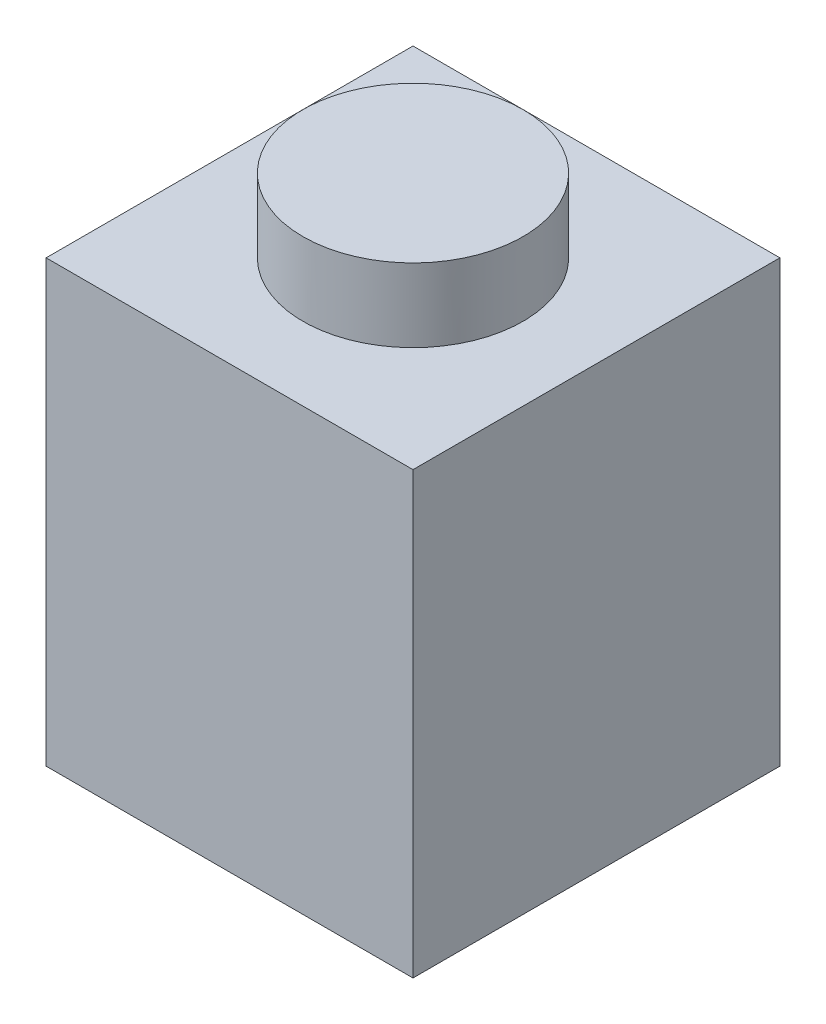
ISO-10303-21;
HEADER;
FILE_DESCRIPTION(('STEP AP214'),'2;1');
FILE_NAME('part.step','',(''),(''),'','','');
FILE_SCHEMA(('AUTOMOTIVE_DESIGN { 1 0 10303 214 1 1 1 1 }'));
ENDSEC;
DATA;
#1=APPLICATION_CONTEXT('core data for automotive mechanical design processes');
#2=APPLICATION_PROTOCOL_DEFINITION('international standard','automotive_design',2000,#1);
#3=PRODUCT_CONTEXT('',#1,'mechanical');
#4=PRODUCT('Part','Part','',(#3));
#5=PRODUCT_RELATED_PRODUCT_CATEGORY('part','',(#4));
#6=PRODUCT_DEFINITION_FORMATION('','',#4);
#7=PRODUCT_DEFINITION_CONTEXT('part definition',#1,'design');
#8=PRODUCT_DEFINITION('design','',#6,#7);
#9=PRODUCT_DEFINITION_SHAPE('','',#8);
#10=(LENGTH_UNIT() NAMED_UNIT(*) SI_UNIT(.MILLI.,.METRE.));
#11=(NAMED_UNIT(*) PLANE_ANGLE_UNIT() SI_UNIT($,.RADIAN.));
#12=(NAMED_UNIT(*) SI_UNIT($,.STERADIAN.) SOLID_ANGLE_UNIT());
#13=UNCERTAINTY_MEASURE_WITH_UNIT(LENGTH_MEASURE(1.E-05),#10,'distance_accuracy_value','');
#14=(GEOMETRIC_REPRESENTATION_CONTEXT(3) GLOBAL_UNCERTAINTY_ASSIGNED_CONTEXT((#13)) GLOBAL_UNIT_ASSIGNED_CONTEXT((#10,
#11,#12)) REPRESENTATION_CONTEXT('',''));
#15=CARTESIAN_POINT('',(0.,0.,0.));
#16=DIRECTION('',(0.,0.,1.));
#17=DIRECTION('',(1.,0.,0.));
#18=AXIS2_PLACEMENT_3D('',#15,#16,#17);
#19=CARTESIAN_POINT('',(0.,0.,0.));
#20=DIRECTION('',(0.,-1.,0.));
#21=DIRECTION('',(0.,0.,-1.));
#22=AXIS2_PLACEMENT_3D('',#19,#20,#21);
#23=PLANE('',#22);
#24=DIRECTION('',(0.,0.,1.));
#25=VECTOR('',#24,1.);
#26=CARTESIAN_POINT('',(0.,0.,0.));
#27=LINE('',#26,#25);
#28=CARTESIAN_POINT('',(0.,0.,-8.));
#29=VERTEX_POINT('',#28);
#30=CARTESIAN_POINT('',(0.,0.,0.));
#31=VERTEX_POINT('',#30);
#32=EDGE_CURVE('E155',#29,#31,#27,.T.);
#33=ORIENTED_EDGE('',*,*,#32,.F.);
#34=DIRECTION('',(-1.,0.,0.));
#35=VECTOR('',#34,1.);
#36=CARTESIAN_POINT('',(0.,0.,-8.));
#37=LINE('',#36,#35);
#38=CARTESIAN_POINT('',(8.,0.,-8.));
#39=VERTEX_POINT('',#38);
#40=EDGE_CURVE('E78',#39,#29,#37,.T.);
#41=ORIENTED_EDGE('',*,*,#40,.F.);
#42=DIRECTION('',(0.,0.,-1.));
#43=VECTOR('',#42,1.);
#44=CARTESIAN_POINT('',(8.00000000000001,0.,0.));
#45=LINE('',#44,#43);
#46=CARTESIAN_POINT('',(8.00000000000001,0.,0.));
#47=VERTEX_POINT('',#46);
#48=EDGE_CURVE('E167',#47,#39,#45,.T.);
#49=ORIENTED_EDGE('',*,*,#48,.F.);
#50=DIRECTION('',(1.,0.,0.));
#51=VECTOR('',#50,1.);
#52=CARTESIAN_POINT('',(0.,0.,0.));
#53=LINE('',#52,#51);
#54=EDGE_CURVE('E165',#31,#47,#53,.T.);
#55=ORIENTED_EDGE('',*,*,#54,.F.);
#56=EDGE_LOOP('',(#33,#41,#49,#55));
#57=FACE_BOUND('',#56,.T.);
#58=DIRECTION('',(-1.,0.,0.));
#59=VECTOR('',#58,1.);
#60=CARTESIAN_POINT('',(0.,0.,-6.2));
#61=LINE('',#60,#59);
#62=CARTESIAN_POINT('',(6.2,0.,-6.2));
#63=VERTEX_POINT('',#62);
#64=CARTESIAN_POINT('',(1.8,0.,-6.2));
#65=VERTEX_POINT('',#64);
#66=EDGE_CURVE('E148',#63,#65,#61,.T.);
#67=ORIENTED_EDGE('',*,*,#66,.T.);
#68=DIRECTION('',(0.,0.,1.));
#69=VECTOR('',#68,1.);
#70=CARTESIAN_POINT('',(1.8,0.,0.));
#71=LINE('',#70,#69);
#72=CARTESIAN_POINT('',(1.8,0.,-1.8));
#73=VERTEX_POINT('',#72);
#74=EDGE_CURVE('E144',#65,#73,#71,.T.);
#75=ORIENTED_EDGE('',*,*,#74,.T.);
#76=DIRECTION('',(1.,0.,0.));
#77=VECTOR('',#76,1.);
#78=CARTESIAN_POINT('',(0.,0.,-1.8));
#79=LINE('',#78,#77);
#80=CARTESIAN_POINT('',(6.20000000000001,0.,-1.8));
#81=VERTEX_POINT('',#80);
#82=EDGE_CURVE('E147',#73,#81,#79,.T.);
#83=ORIENTED_EDGE('',*,*,#82,.T.);
#84=DIRECTION('',(0.,0.,-1.));
#85=VECTOR('',#84,1.);
#86=CARTESIAN_POINT('',(6.20000000000001,0.,0.));
#87=LINE('',#86,#85);
#88=EDGE_CURVE('E48',#81,#63,#87,.T.);
#89=ORIENTED_EDGE('',*,*,#88,.T.);
#90=EDGE_LOOP('',(#67,#75,#83,#89));
#91=FACE_BOUND('',#90,.T.);
#92=ADVANCED_FACE('F33',(#57,#91),#23,.T.);
#93=CARTESIAN_POINT('',(0.,9.6,0.));
#94=DIRECTION('',(0.,-1.,0.));
#95=DIRECTION('',(0.,0.,-1.));
#96=AXIS2_PLACEMENT_3D('',#93,#94,#95);
#97=PLANE('',#96);
#98=DIRECTION('',(0.,0.,1.));
#99=VECTOR('',#98,1.);
#100=CARTESIAN_POINT('',(0.,9.6,0.));
#101=LINE('',#100,#99);
#102=CARTESIAN_POINT('',(0.,9.6,-8.));
#103=VERTEX_POINT('',#102);
#104=CARTESIAN_POINT('',(0.,9.6,0.));
#105=VERTEX_POINT('',#104);
#106=EDGE_CURVE('E156',#103,#105,#101,.T.);
#107=ORIENTED_EDGE('',*,*,#106,.T.);
#108=DIRECTION('',(1.,0.,0.));
#109=VECTOR('',#108,1.);
#110=CARTESIAN_POINT('',(0.,9.6,0.));
#111=LINE('',#110,#109);
#112=CARTESIAN_POINT('',(8.00000000000001,9.6,0.));
#113=VERTEX_POINT('',#112);
#114=EDGE_CURVE('E86',#105,#113,#111,.T.);
#115=ORIENTED_EDGE('',*,*,#114,.T.);
#116=DIRECTION('',(0.,0.,-1.));
#117=VECTOR('',#116,1.);
#118=CARTESIAN_POINT('',(8.00000000000001,9.6,0.));
#119=LINE('',#118,#117);
#120=CARTESIAN_POINT('',(8.,9.6,-8.));
#121=VERTEX_POINT('',#120);
#122=EDGE_CURVE('E159',#113,#121,#119,.T.);
#123=ORIENTED_EDGE('',*,*,#122,.T.);
#124=DIRECTION('',(-1.,0.,0.));
#125=VECTOR('',#124,1.);
#126=CARTESIAN_POINT('',(0.,9.6,-8.));
#127=LINE('',#126,#125);
#128=EDGE_CURVE('E57',#121,#103,#127,.T.);
#129=ORIENTED_EDGE('',*,*,#128,.T.);
#130=EDGE_LOOP('',(#107,#115,#123,#129));
#131=FACE_BOUND('',#130,.T.);
#132=CARTESIAN_POINT('',(4.,9.6,-4.));
#133=DIRECTION('',(0.,-1.,0.));
#134=DIRECTION('',(0.,0.,-1.));
#135=AXIS2_PLACEMENT_3D('',#132,#133,#134);
#136=CIRCLE('',#135,2.4);
#137=CARTESIAN_POINT('',(4.,9.6,-6.4));
#138=VERTEX_POINT('',#137);
#139=EDGE_CURVE('E11',#138,#138,#136,.F.);
#140=ORIENTED_EDGE('',*,*,#139,.F.);
#141=EDGE_LOOP('',(#140));
#142=FACE_BOUND('',#141,.T.);
#143=ADVANCED_FACE('F188',(#131,#142),#97,.F.);
#144=CARTESIAN_POINT('',(0.,9.6,0.));
#145=DIRECTION('',(1.,0.,0.));
#146=DIRECTION('',(0.,0.,-1.));
#147=AXIS2_PLACEMENT_3D('',#144,#145,#146);
#148=PLANE('',#147);
#149=ORIENTED_EDGE('',*,*,#32,.T.);
#150=DIRECTION('',(0.,-1.,0.));
#151=VECTOR('',#150,1.);
#152=CARTESIAN_POINT('',(0.,9.6,0.));
#153=LINE('',#152,#151);
#154=EDGE_CURVE('E41',#105,#31,#153,.T.);
#155=ORIENTED_EDGE('',*,*,#154,.F.);
#156=ORIENTED_EDGE('',*,*,#106,.F.);
#157=DIRECTION('',(0.,-1.,0.));
#158=VECTOR('',#157,1.);
#159=CARTESIAN_POINT('',(0.,9.6,-8.));
#160=LINE('',#159,#158);
#161=EDGE_CURVE('E162',#103,#29,#160,.T.);
#162=ORIENTED_EDGE('',*,*,#161,.T.);
#163=EDGE_LOOP('',(#149,#155,#156,#162));
#164=FACE_BOUND('',#163,.T.);
#165=ADVANCED_FACE('F35',(#164),#148,.F.);
#166=CARTESIAN_POINT('',(0.,9.6,0.));
#167=DIRECTION('',(0.,0.,-1.));
#168=DIRECTION('',(-1.,0.,0.));
#169=AXIS2_PLACEMENT_3D('',#166,#167,#168);
#170=PLANE('',#169);
#171=ORIENTED_EDGE('',*,*,#54,.T.);
#172=DIRECTION('',(0.,-1.,0.));
#173=VECTOR('',#172,1.);
#174=CARTESIAN_POINT('',(8.00000000000001,9.6,0.));
#175=LINE('',#174,#173);
#176=EDGE_CURVE('E173',#113,#47,#175,.T.);
#177=ORIENTED_EDGE('',*,*,#176,.F.);
#178=ORIENTED_EDGE('',*,*,#114,.F.);
#179=ORIENTED_EDGE('',*,*,#154,.T.);
#180=EDGE_LOOP('',(#171,#177,#178,#179));
#181=FACE_BOUND('',#180,.T.);
#182=ADVANCED_FACE('F176',(#181),#170,.F.);
#183=CARTESIAN_POINT('',(8.00000000000001,9.6,0.));
#184=DIRECTION('',(-1.,0.,0.));
#185=DIRECTION('',(0.,0.,1.));
#186=AXIS2_PLACEMENT_3D('',#183,#184,#185);
#187=PLANE('',#186);
#188=ORIENTED_EDGE('',*,*,#48,.T.);
#189=DIRECTION('',(0.,-1.,0.));
#190=VECTOR('',#189,1.);
#191=CARTESIAN_POINT('',(8.,9.6,-8.));
#192=LINE('',#191,#190);
#193=EDGE_CURVE('E171',#121,#39,#192,.T.);
#194=ORIENTED_EDGE('',*,*,#193,.F.);
#195=ORIENTED_EDGE('',*,*,#122,.F.);
#196=ORIENTED_EDGE('',*,*,#176,.T.);
#197=EDGE_LOOP('',(#188,#194,#195,#196));
#198=FACE_BOUND('',#197,.T.);
#199=ADVANCED_FACE('F185',(#198),#187,.F.);
#200=CARTESIAN_POINT('',(0.,9.6,-8.));
#201=DIRECTION('',(0.,0.,1.));
#202=DIRECTION('',(1.,0.,0.));
#203=AXIS2_PLACEMENT_3D('',#200,#201,#202);
#204=PLANE('',#203);
#205=ORIENTED_EDGE('',*,*,#40,.T.);
#206=ORIENTED_EDGE('',*,*,#161,.F.);
#207=ORIENTED_EDGE('',*,*,#128,.F.);
#208=ORIENTED_EDGE('',*,*,#193,.T.);
#209=EDGE_LOOP('',(#205,#206,#207,#208));
#210=FACE_BOUND('',#209,.T.);
#211=ADVANCED_FACE('F187',(#210),#204,.F.);
#212=CARTESIAN_POINT('',(4.,11.2,-4.));
#213=DIRECTION('',(0.,-1.,0.));
#214=DIRECTION('',(0.,0.,-1.));
#215=AXIS2_PLACEMENT_3D('',#212,#213,#214);
#216=CYLINDRICAL_SURFACE('',#215,2.4);
#217=CARTESIAN_POINT('',(4.,11.2,-4.));
#218=DIRECTION('',(0.,1.,0.));
#219=DIRECTION('',(0.,0.,1.));
#220=AXIS2_PLACEMENT_3D('',#217,#218,#219);
#221=CIRCLE('',#220,2.4);
#222=CARTESIAN_POINT('',(4.,11.2,-1.6));
#223=VERTEX_POINT('',#222);
#224=EDGE_CURVE('E137',#223,#223,#221,.T.);
#225=ORIENTED_EDGE('',*,*,#224,.F.);
#226=EDGE_LOOP('',(#225));
#227=FACE_BOUND('',#226,.T.);
#228=ORIENTED_EDGE('',*,*,#139,.T.);
#229=EDGE_LOOP('',(#228));
#230=FACE_BOUND('',#229,.T.);
#231=ADVANCED_FACE('F194',(#227,#230),#216,.T.);
#232=CARTESIAN_POINT('',(4.,11.2,-4.));
#233=DIRECTION('',(0.,1.,0.));
#234=DIRECTION('',(0.,0.,1.));
#235=AXIS2_PLACEMENT_3D('',#232,#233,#234);
#236=PLANE('',#235);
#237=ORIENTED_EDGE('',*,*,#224,.T.);
#238=EDGE_LOOP('',(#237));
#239=FACE_BOUND('',#238,.T.);
#240=ADVANCED_FACE('F196',(#239),#236,.T.);
#241=CARTESIAN_POINT('',(0.,7.8,0.));
#242=DIRECTION('',(0.,-1.,0.));
#243=DIRECTION('',(0.,0.,-1.));
#244=AXIS2_PLACEMENT_3D('',#241,#242,#243);
#245=PLANE('',#244);
#246=DIRECTION('',(0.,0.,1.));
#247=VECTOR('',#246,1.);
#248=CARTESIAN_POINT('',(1.8,7.8,0.));
#249=LINE('',#248,#247);
#250=CARTESIAN_POINT('',(1.8,7.8,-6.2));
#251=VERTEX_POINT('',#250);
#252=CARTESIAN_POINT('',(1.8,7.8,-1.8));
#253=VERTEX_POINT('',#252);
#254=EDGE_CURVE('E119',#251,#253,#249,.T.);
#255=ORIENTED_EDGE('',*,*,#254,.F.);
#256=DIRECTION('',(-1.,0.,0.));
#257=VECTOR('',#256,1.);
#258=CARTESIAN_POINT('',(0.,7.8,-6.2));
#259=LINE('',#258,#257);
#260=CARTESIAN_POINT('',(6.2,7.8,-6.2));
#261=VERTEX_POINT('',#260);
#262=EDGE_CURVE('E128',#261,#251,#259,.T.);
#263=ORIENTED_EDGE('',*,*,#262,.F.);
#264=DIRECTION('',(0.,0.,-1.));
#265=VECTOR('',#264,1.);
#266=CARTESIAN_POINT('',(6.20000000000001,7.8,0.));
#267=LINE('',#266,#265);
#268=CARTESIAN_POINT('',(6.20000000000001,7.8,-1.8));
#269=VERTEX_POINT('',#268);
#270=EDGE_CURVE('E118',#269,#261,#267,.T.);
#271=ORIENTED_EDGE('',*,*,#270,.F.);
#272=DIRECTION('',(1.,0.,0.));
#273=VECTOR('',#272,1.);
#274=CARTESIAN_POINT('',(0.,7.8,-1.8));
#275=LINE('',#274,#273);
#276=EDGE_CURVE('E108',#253,#269,#275,.T.);
#277=ORIENTED_EDGE('',*,*,#276,.F.);
#278=EDGE_LOOP('',(#255,#263,#271,#277));
#279=FACE_BOUND('',#278,.T.);
#280=CARTESIAN_POINT('',(4.,7.8,-4.));
#281=DIRECTION('',(0.,-1.,0.));
#282=DIRECTION('',(0.,0.,-1.));
#283=AXIS2_PLACEMENT_3D('',#280,#281,#282);
#284=CIRCLE('',#283,0.599999999999999);
#285=CARTESIAN_POINT('',(4.,7.8,-4.6));
#286=VERTEX_POINT('',#285);
#287=EDGE_CURVE('E134',#286,#286,#284,.F.);
#288=ORIENTED_EDGE('',*,*,#287,.T.);
#289=EDGE_LOOP('',(#288));
#290=FACE_BOUND('',#289,.T.);
#291=ADVANCED_FACE('F126',(#279,#290),#245,.T.);
#292=CARTESIAN_POINT('',(1.8,9.6,0.));
#293=DIRECTION('',(1.,0.,0.));
#294=DIRECTION('',(0.,0.,-1.));
#295=AXIS2_PLACEMENT_3D('',#292,#293,#294);
#296=PLANE('',#295);
#297=ORIENTED_EDGE('',*,*,#74,.F.);
#298=DIRECTION('',(0.,-1.,0.));
#299=VECTOR('',#298,1.);
#300=CARTESIAN_POINT('',(1.8,9.6,-6.2));
#301=LINE('',#300,#299);
#302=EDGE_CURVE('E130',#251,#65,#301,.T.);
#303=ORIENTED_EDGE('',*,*,#302,.F.);
#304=ORIENTED_EDGE('',*,*,#254,.T.);
#305=DIRECTION('',(0.,-1.,0.));
#306=VECTOR('',#305,1.);
#307=CARTESIAN_POINT('',(1.8,9.6,-1.8));
#308=LINE('',#307,#306);
#309=EDGE_CURVE('E113',#253,#73,#308,.T.);
#310=ORIENTED_EDGE('',*,*,#309,.T.);
#311=EDGE_LOOP('',(#297,#303,#304,#310));
#312=FACE_BOUND('',#311,.T.);
#313=ADVANCED_FACE('F250',(#312),#296,.T.);
#314=CARTESIAN_POINT('',(0.,9.6,-1.8));
#315=DIRECTION('',(0.,0.,-1.));
#316=DIRECTION('',(-1.,0.,0.));
#317=AXIS2_PLACEMENT_3D('',#314,#315,#316);
#318=PLANE('',#317);
#319=ORIENTED_EDGE('',*,*,#82,.F.);
#320=ORIENTED_EDGE('',*,*,#309,.F.);
#321=ORIENTED_EDGE('',*,*,#276,.T.);
#322=DIRECTION('',(0.,-1.,0.));
#323=VECTOR('',#322,1.);
#324=CARTESIAN_POINT('',(6.20000000000001,9.6,-1.8));
#325=LINE('',#324,#323);
#326=EDGE_CURVE('E110',#269,#81,#325,.T.);
#327=ORIENTED_EDGE('',*,*,#326,.T.);
#328=EDGE_LOOP('',(#319,#320,#321,#327));
#329=FACE_BOUND('',#328,.T.);
#330=ADVANCED_FACE('F109',(#329),#318,.T.);
#331=CARTESIAN_POINT('',(6.20000000000001,9.6,0.));
#332=DIRECTION('',(-1.,0.,0.));
#333=DIRECTION('',(0.,0.,1.));
#334=AXIS2_PLACEMENT_3D('',#331,#332,#333);
#335=PLANE('',#334);
#336=ORIENTED_EDGE('',*,*,#88,.F.);
#337=ORIENTED_EDGE('',*,*,#326,.F.);
#338=ORIENTED_EDGE('',*,*,#270,.T.);
#339=DIRECTION('',(0.,-1.,0.));
#340=VECTOR('',#339,1.);
#341=CARTESIAN_POINT('',(6.2,9.6,-6.2));
#342=LINE('',#341,#340);
#343=EDGE_CURVE('E123',#261,#63,#342,.T.);
#344=ORIENTED_EDGE('',*,*,#343,.T.);
#345=EDGE_LOOP('',(#336,#337,#338,#344));
#346=FACE_BOUND('',#345,.T.);
#347=ADVANCED_FACE('F121',(#346),#335,.T.);
#348=CARTESIAN_POINT('',(0.,9.6,-6.2));
#349=DIRECTION('',(0.,0.,1.));
#350=DIRECTION('',(1.,0.,0.));
#351=AXIS2_PLACEMENT_3D('',#348,#349,#350);
#352=PLANE('',#351);
#353=ORIENTED_EDGE('',*,*,#66,.F.);
#354=ORIENTED_EDGE('',*,*,#343,.F.);
#355=ORIENTED_EDGE('',*,*,#262,.T.);
#356=ORIENTED_EDGE('',*,*,#302,.T.);
#357=EDGE_LOOP('',(#353,#354,#355,#356));
#358=FACE_BOUND('',#357,.T.);
#359=ADVANCED_FACE('F276',(#358),#352,.T.);
#360=CARTESIAN_POINT('',(4.,11.2,-4.));
#361=DIRECTION('',(0.,-1.,0.));
#362=DIRECTION('',(0.,0.,-1.));
#363=AXIS2_PLACEMENT_3D('',#360,#361,#362);
#364=CYLINDRICAL_SURFACE('',#363,0.599999999999999);
#365=CARTESIAN_POINT('',(4.,9.4,-4.));
#366=DIRECTION('',(0.,1.,0.));
#367=DIRECTION('',(0.,0.,1.));
#368=AXIS2_PLACEMENT_3D('',#365,#366,#367);
#369=CIRCLE('',#368,0.599999999999999);
#370=CARTESIAN_POINT('',(4.,9.4,-3.4));
#371=VERTEX_POINT('',#370);
#372=EDGE_CURVE('E141',#371,#371,#369,.T.);
#373=ORIENTED_EDGE('',*,*,#372,.T.);
#374=EDGE_LOOP('',(#373));
#375=FACE_BOUND('',#374,.T.);
#376=ORIENTED_EDGE('',*,*,#287,.F.);
#377=EDGE_LOOP('',(#376));
#378=FACE_BOUND('',#377,.T.);
#379=ADVANCED_FACE('F285',(#375,#378),#364,.F.);
#380=CARTESIAN_POINT('',(4.,9.4,-4.));
#381=DIRECTION('',(0.,1.,0.));
#382=DIRECTION('',(0.,0.,1.));
#383=AXIS2_PLACEMENT_3D('',#380,#381,#382);
#384=PLANE('',#383);
#385=ORIENTED_EDGE('',*,*,#372,.F.);
#386=EDGE_LOOP('',(#385));
#387=FACE_BOUND('',#386,.T.);
#388=ADVANCED_FACE('F295',(#387),#384,.F.);
#389=CLOSED_SHELL('',(#92,#143,#165,#182,#199,#211,#231,#240,#291,#313,#330,#347,#359,#379,#388));
#390=MANIFOLD_SOLID_BREP('B2',#389);
#391=ADVANCED_BREP_SHAPE_REPRESENTATION('',(#18,#390),#14);
#392=SHAPE_DEFINITION_REPRESENTATION(#9,#391);
ENDSEC;
END-ISO-10303-21;
